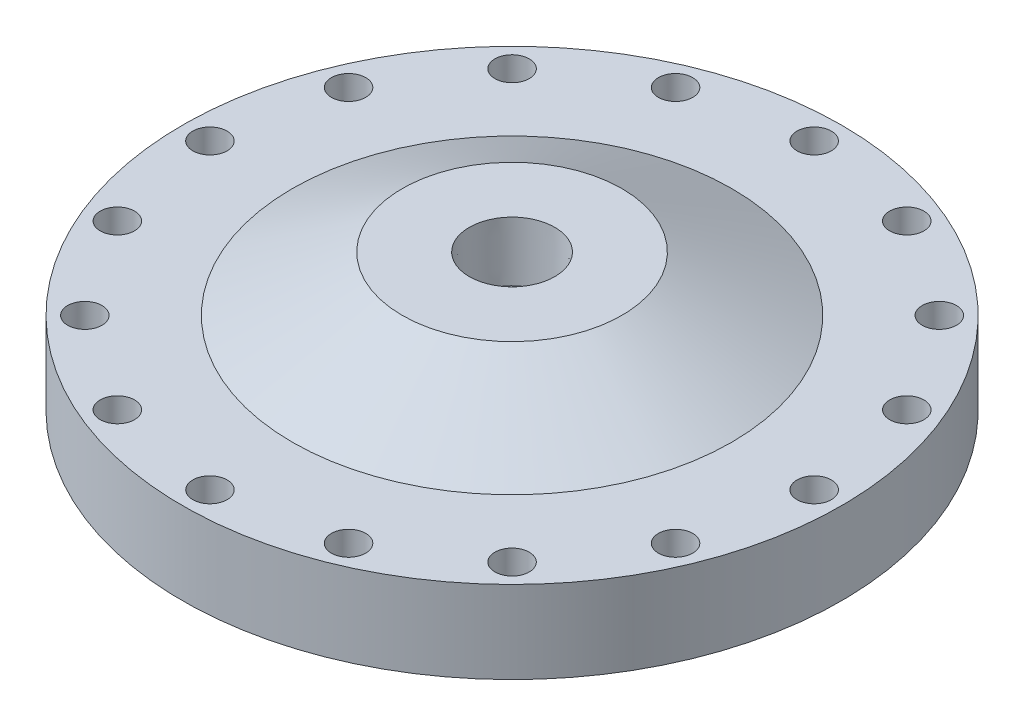
ISO-10303-21;
HEADER;
FILE_DESCRIPTION(('STEP AP214'),'2;1');
FILE_NAME('part.step','',(''),(''),'','','');
FILE_SCHEMA(('AUTOMOTIVE_DESIGN { 1 0 10303 214 1 1 1 1 }'));
ENDSEC;
DATA;
#1=APPLICATION_CONTEXT('core data for automotive mechanical design processes');
#2=APPLICATION_PROTOCOL_DEFINITION('international standard','automotive_design',2000,#1);
#3=PRODUCT_CONTEXT('',#1,'mechanical');
#4=PRODUCT('Part','Part','',(#3));
#5=PRODUCT_RELATED_PRODUCT_CATEGORY('part','',(#4));
#6=PRODUCT_DEFINITION_FORMATION('','',#4);
#7=PRODUCT_DEFINITION_CONTEXT('part definition',#1,'design');
#8=PRODUCT_DEFINITION('design','',#6,#7);
#9=PRODUCT_DEFINITION_SHAPE('','',#8);
#10=(LENGTH_UNIT() NAMED_UNIT(*) SI_UNIT(.MILLI.,.METRE.));
#11=(NAMED_UNIT(*) PLANE_ANGLE_UNIT() SI_UNIT($,.RADIAN.));
#12=(NAMED_UNIT(*) SI_UNIT($,.STERADIAN.) SOLID_ANGLE_UNIT());
#13=UNCERTAINTY_MEASURE_WITH_UNIT(LENGTH_MEASURE(1.E-05),#10,'distance_accuracy_value','');
#14=(GEOMETRIC_REPRESENTATION_CONTEXT(3) GLOBAL_UNCERTAINTY_ASSIGNED_CONTEXT((#13)) GLOBAL_UNIT_ASSIGNED_CONTEXT((#10,
#11,#12)) REPRESENTATION_CONTEXT('',''));
#15=CARTESIAN_POINT('',(0.,0.,0.));
#16=DIRECTION('',(0.,0.,1.));
#17=DIRECTION('',(1.,0.,0.));
#18=AXIS2_PLACEMENT_3D('',#15,#16,#17);
#19=CARTESIAN_POINT('',(-50.8,-12.7,0.));
#20=DIRECTION('',(0.,-1.,0.));
#21=DIRECTION('',(0.,0.,-1.));
#22=AXIS2_PLACEMENT_3D('',#19,#20,#21);
#23=PLANE('',#22);
#24=CARTESIAN_POINT('',(-49.3914086658803,-12.7,-49.3914086658804));
#25=DIRECTION('',(0.,1.,0.));
#26=DIRECTION('',(-0.707106781186549,0.,0.707106781186546));
#27=AXIS2_PLACEMENT_3D('',#24,#25,#26);
#28=CIRCLE('',#27,3.96874999999999);
#29=CARTESIAN_POINT('',(-52.1977387037144,-12.7,-46.5850786280463));
#30=VERTEX_POINT('',#29);
#31=EDGE_CURVE('E115',#30,#30,#28,.T.);
#32=ORIENTED_EDGE('',*,*,#31,.F.);
#33=EDGE_LOOP('',(#32));
#34=FACE_BOUND('',#33,.T.);
#35=CARTESIAN_POINT('',(-26.7304377507013,-12.7,-64.5329853459134));
#36=DIRECTION('',(0.,1.,0.));
#37=DIRECTION('',(-0.923879532511288,0.,0.382683432365087));
#38=AXIS2_PLACEMENT_3D('',#35,#36,#37);
#39=CIRCLE('',#38,3.96874999999999);
#40=CARTESIAN_POINT('',(-30.3970846453555,-12.7,-63.0142104737145));
#41=VERTEX_POINT('',#40);
#42=EDGE_CURVE('E109',#41,#41,#39,.T.);
#43=ORIENTED_EDGE('',*,*,#42,.F.);
#44=EDGE_LOOP('',(#43));
#45=FACE_BOUND('',#44,.T.);
#46=CARTESIAN_POINT('',(2.43879971518193E-13,-12.7,-69.85));
#47=DIRECTION('',(0.,1.,0.));
#48=DIRECTION('',(-1.,0.,0.));
#49=AXIS2_PLACEMENT_3D('',#46,#47,#48);
#50=CIRCLE('',#49,3.96874999999999);
#51=CARTESIAN_POINT('',(-3.96874999999975,-12.7,-69.85));
#52=VERTEX_POINT('',#51);
#53=EDGE_CURVE('E103',#52,#52,#50,.T.);
#54=ORIENTED_EDGE('',*,*,#53,.F.);
#55=EDGE_LOOP('',(#54));
#56=FACE_BOUND('',#55,.T.);
#57=CARTESIAN_POINT('',(26.7304377507018,-12.7,-64.5329853459133));
#58=DIRECTION('',(0.,1.,0.));
#59=DIRECTION('',(-0.923879532511285,0.,-0.382683432365094));
#60=AXIS2_PLACEMENT_3D('',#57,#58,#59);
#61=CIRCLE('',#60,3.96874999999999);
#62=CARTESIAN_POINT('',(23.0637908560476,-12.7,-66.0517602181122));
#63=VERTEX_POINT('',#62);
#64=EDGE_CURVE('E97',#63,#63,#61,.T.);
#65=ORIENTED_EDGE('',*,*,#64,.F.);
#66=EDGE_LOOP('',(#65));
#67=FACE_BOUND('',#66,.T.);
#68=CARTESIAN_POINT('',(49.3914086658806,-12.7,-49.3914086658801));
#69=DIRECTION('',(0.,1.,0.));
#70=DIRECTION('',(-0.707106781186544,0.,-0.707106781186551));
#71=AXIS2_PLACEMENT_3D('',#68,#69,#70);
#72=CIRCLE('',#71,3.96874999999999);
#73=CARTESIAN_POINT('',(46.5850786280465,-12.7,-52.1977387037142));
#74=VERTEX_POINT('',#73);
#75=EDGE_CURVE('E91',#74,#74,#72,.T.);
#76=ORIENTED_EDGE('',*,*,#75,.F.);
#77=EDGE_LOOP('',(#76));
#78=FACE_BOUND('',#77,.T.);
#79=CARTESIAN_POINT('',(64.5329853459135,-12.7,-26.7304377507011));
#80=DIRECTION('',(0.,1.,0.));
#81=DIRECTION('',(-0.382683432365084,0.,-0.923879532511289));
#82=AXIS2_PLACEMENT_3D('',#79,#80,#81);
#83=CIRCLE('',#82,3.96874999999999);
#84=CARTESIAN_POINT('',(63.0142104737146,-12.7,-30.3970846453553));
#85=VERTEX_POINT('',#84);
#86=EDGE_CURVE('E85',#85,#85,#83,.T.);
#87=ORIENTED_EDGE('',*,*,#86,.F.);
#88=EDGE_LOOP('',(#87));
#89=FACE_BOUND('',#88,.T.);
#90=CARTESIAN_POINT('',(69.85,-12.7,0.));
#91=DIRECTION('',(0.,1.,0.));
#92=DIRECTION('',(0.,0.,-1.));
#93=AXIS2_PLACEMENT_3D('',#90,#91,#92);
#94=CIRCLE('',#93,3.96874999999999);
#95=CARTESIAN_POINT('',(69.85,-12.7,-3.96874999999999));
#96=VERTEX_POINT('',#95);
#97=EDGE_CURVE('E77',#96,#96,#94,.T.);
#98=ORIENTED_EDGE('',*,*,#97,.F.);
#99=EDGE_LOOP('',(#98));
#100=FACE_BOUND('',#99,.T.);
#101=CARTESIAN_POINT('',(64.5329853459132,-12.7,26.730437750702));
#102=DIRECTION('',(0.,1.,0.));
#103=DIRECTION('',(0.382683432365097,0.,-0.923879532511284));
#104=AXIS2_PLACEMENT_3D('',#101,#102,#103);
#105=CIRCLE('',#104,3.96874999999999);
#106=CARTESIAN_POINT('',(66.0517602181121,-12.7,23.0637908560479));
#107=VERTEX_POINT('',#106);
#108=EDGE_CURVE('E78',#107,#107,#105,.T.);
#109=ORIENTED_EDGE('',*,*,#108,.F.);
#110=EDGE_LOOP('',(#109));
#111=FACE_BOUND('',#110,.T.);
#112=CARTESIAN_POINT('',(49.3914086658799,-12.7,49.3914086658808));
#113=DIRECTION('',(0.,1.,0.));
#114=DIRECTION('',(0.707106781186554,0.,-0.707106781186541));
#115=AXIS2_PLACEMENT_3D('',#112,#113,#114);
#116=CIRCLE('',#115,3.96874999999999);
#117=CARTESIAN_POINT('',(52.197738703714,-12.7,46.5850786280467));
#118=VERTEX_POINT('',#117);
#119=EDGE_CURVE('E151',#118,#118,#116,.T.);
#120=ORIENTED_EDGE('',*,*,#119,.F.);
#121=EDGE_LOOP('',(#120));
#122=FACE_BOUND('',#121,.T.);
#123=CARTESIAN_POINT('',(26.7304377507009,-12.7,64.5329853459136));
#124=DIRECTION('',(0.,1.,0.));
#125=DIRECTION('',(0.923879532511291,0.,-0.382683432365081));
#126=AXIS2_PLACEMENT_3D('',#123,#124,#125);
#127=CIRCLE('',#126,3.96874999999999);
#128=CARTESIAN_POINT('',(30.3970846453551,-12.7,63.0142104737147));
#129=VERTEX_POINT('',#128);
#130=EDGE_CURVE('E145',#129,#129,#127,.T.);
#131=ORIENTED_EDGE('',*,*,#130,.F.);
#132=EDGE_LOOP('',(#131));
#133=FACE_BOUND('',#132,.T.);
#134=CARTESIAN_POINT('',(-7.31639914554579E-13,-12.7,69.85));
#135=DIRECTION('',(0.,1.,0.));
#136=DIRECTION('',(1.,0.,0.));
#137=AXIS2_PLACEMENT_3D('',#134,#135,#136);
#138=CIRCLE('',#137,3.96874999999999);
#139=CARTESIAN_POINT('',(3.96874999999926,-12.7,69.85));
#140=VERTEX_POINT('',#139);
#141=EDGE_CURVE('E139',#140,#140,#138,.T.);
#142=ORIENTED_EDGE('',*,*,#141,.F.);
#143=EDGE_LOOP('',(#142));
#144=FACE_BOUND('',#143,.T.);
#145=CARTESIAN_POINT('',(-26.7304377507022,-12.7,64.5329853459131));
#146=DIRECTION('',(0.,1.,0.));
#147=DIRECTION('',(0.923879532511283,0.,0.3826834323651));
#148=AXIS2_PLACEMENT_3D('',#145,#146,#147);
#149=CIRCLE('',#148,3.96874999999999);
#150=CARTESIAN_POINT('',(-23.0637908560481,-12.7,66.0517602181121));
#151=VERTEX_POINT('',#150);
#152=EDGE_CURVE('E133',#151,#151,#149,.T.);
#153=ORIENTED_EDGE('',*,*,#152,.F.);
#154=EDGE_LOOP('',(#153));
#155=FACE_BOUND('',#154,.T.);
#156=CARTESIAN_POINT('',(-49.3914086658809,-12.7,49.3914086658797));
#157=DIRECTION('',(0.,1.,0.));
#158=DIRECTION('',(0.707106781186539,0.,0.707106781186556));
#159=AXIS2_PLACEMENT_3D('',#156,#157,#158);
#160=CIRCLE('',#159,3.96874999999999);
#161=CARTESIAN_POINT('',(-46.5850786280469,-12.7,52.1977387037139));
#162=VERTEX_POINT('',#161);
#163=EDGE_CURVE('E125',#162,#162,#160,.T.);
#164=ORIENTED_EDGE('',*,*,#163,.F.);
#165=EDGE_LOOP('',(#164));
#166=FACE_BOUND('',#165,.T.);
#167=CARTESIAN_POINT('',(-64.5329853459137,-12.7,26.7304377507006));
#168=DIRECTION('',(0.,1.,0.));
#169=DIRECTION('',(0.382683432365077,0.,0.923879532511292));
#170=AXIS2_PLACEMENT_3D('',#167,#168,#169);
#171=CIRCLE('',#170,3.96874999999999);
#172=CARTESIAN_POINT('',(-63.0142104737148,-12.7,30.3970846453548));
#173=VERTEX_POINT('',#172);
#174=EDGE_CURVE('E126',#173,#173,#171,.T.);
#175=ORIENTED_EDGE('',*,*,#174,.F.);
#176=EDGE_LOOP('',(#175));
#177=FACE_BOUND('',#176,.T.);
#178=CARTESIAN_POINT('',(-64.5329853459134,-12.7,-26.7304377507016));
#179=DIRECTION('',(0.,1.,0.));
#180=DIRECTION('',(-0.382683432365091,0.,0.923879532511287));
#181=AXIS2_PLACEMENT_3D('',#178,#179,#180);
#182=CIRCLE('',#181,3.96874999999999);
#183=CARTESIAN_POINT('',(-66.0517602181123,-12.7,-23.0637908560474));
#184=VERTEX_POINT('',#183);
#185=EDGE_CURVE('E70',#184,#184,#182,.T.);
#186=ORIENTED_EDGE('',*,*,#185,.F.);
#187=EDGE_LOOP('',(#186));
#188=FACE_BOUND('',#187,.T.);
#189=CARTESIAN_POINT('',(-69.85,-12.7,0.));
#190=DIRECTION('',(0.,1.,0.));
#191=DIRECTION('',(0.,0.,1.));
#192=AXIS2_PLACEMENT_3D('',#189,#190,#191);
#193=CIRCLE('',#192,3.96874999999999);
#194=CARTESIAN_POINT('',(-69.85,-12.7,3.96874999999999));
#195=VERTEX_POINT('',#194);
#196=EDGE_CURVE('E64',#195,#195,#193,.T.);
#197=ORIENTED_EDGE('',*,*,#196,.F.);
#198=EDGE_LOOP('',(#197));
#199=FACE_BOUND('',#198,.T.);
#200=CARTESIAN_POINT('',(0.,-12.7,0.));
#201=DIRECTION('',(0.,-1.,0.));
#202=DIRECTION('',(0.,0.,-1.));
#203=AXIS2_PLACEMENT_3D('',#200,#201,#202);
#204=CIRCLE('',#203,76.2);
#205=CARTESIAN_POINT('',(0.,-12.7,-76.2));
#206=VERTEX_POINT('',#205);
#207=EDGE_CURVE('E10',#206,#206,#204,.T.);
#208=ORIENTED_EDGE('',*,*,#207,.F.);
#209=EDGE_LOOP('',(#208));
#210=FACE_BOUND('',#209,.T.);
#211=CARTESIAN_POINT('',(0.,-12.7,0.));
#212=DIRECTION('',(0.,-1.,0.));
#213=DIRECTION('',(0.,0.,-1.));
#214=AXIS2_PLACEMENT_3D('',#211,#212,#213);
#215=CIRCLE('',#214,50.8);
#216=CARTESIAN_POINT('',(0.,-12.7,-50.8));
#217=VERTEX_POINT('',#216);
#218=EDGE_CURVE('E58',#217,#217,#215,.T.);
#219=ORIENTED_EDGE('',*,*,#218,.T.);
#220=EDGE_LOOP('',(#219));
#221=FACE_BOUND('',#220,.T.);
#222=ADVANCED_FACE('F36',(#34,#45,#56,#67,#78,#89,#100,#111,#122,#133,#144,#155,#166,#177,#188,
#199,#210,#221),#23,.F.);
#223=CARTESIAN_POINT('',(0.,-19.05,0.));
#224=DIRECTION('',(0.,-1.,0.));
#225=DIRECTION('',(0.,0.,-1.));
#226=AXIS2_PLACEMENT_3D('',#223,#224,#225);
#227=CYLINDRICAL_SURFACE('',#226,76.2);
#228=CARTESIAN_POINT('',(0.,-31.75,0.));
#229=DIRECTION('',(0.,-1.,0.));
#230=DIRECTION('',(0.,0.,-1.));
#231=AXIS2_PLACEMENT_3D('',#228,#229,#230);
#232=CIRCLE('',#231,76.2);
#233=CARTESIAN_POINT('',(0.,-31.75,-76.2));
#234=VERTEX_POINT('',#233);
#235=EDGE_CURVE('E42',#234,#234,#232,.T.);
#236=ORIENTED_EDGE('',*,*,#235,.F.);
#237=EDGE_LOOP('',(#236));
#238=FACE_BOUND('',#237,.T.);
#239=ORIENTED_EDGE('',*,*,#207,.T.);
#240=EDGE_LOOP('',(#239));
#241=FACE_BOUND('',#240,.T.);
#242=ADVANCED_FACE('F192',(#238,#241),#227,.T.);
#243=CARTESIAN_POINT('',(-76.2,-31.75,0.));
#244=DIRECTION('',(0.,1.,0.));
#245=DIRECTION('',(0.,0.,1.));
#246=AXIS2_PLACEMENT_3D('',#243,#244,#245);
#247=PLANE('',#246);
#248=CARTESIAN_POINT('',(-49.3914086658803,-31.75,-49.3914086658804));
#249=DIRECTION('',(0.,1.,0.));
#250=DIRECTION('',(-0.707106781186549,0.,0.707106781186546));
#251=AXIS2_PLACEMENT_3D('',#248,#249,#250);
#252=CIRCLE('',#251,3.96874999999999);
#253=CARTESIAN_POINT('',(-52.1977387037144,-31.75,-46.5850786280463));
#254=VERTEX_POINT('',#253);
#255=EDGE_CURVE('E73',#254,#254,#252,.T.);
#256=ORIENTED_EDGE('',*,*,#255,.T.);
#257=EDGE_LOOP('',(#256));
#258=FACE_BOUND('',#257,.T.);
#259=CARTESIAN_POINT('',(-26.7304377507013,-31.75,-64.5329853459134));
#260=DIRECTION('',(0.,1.,0.));
#261=DIRECTION('',(-0.923879532511288,0.,0.382683432365087));
#262=AXIS2_PLACEMENT_3D('',#259,#260,#261);
#263=CIRCLE('',#262,3.96874999999999);
#264=CARTESIAN_POINT('',(-30.3970846453555,-31.75,-63.0142104737145));
#265=VERTEX_POINT('',#264);
#266=EDGE_CURVE('E112',#265,#265,#263,.T.);
#267=ORIENTED_EDGE('',*,*,#266,.T.);
#268=EDGE_LOOP('',(#267));
#269=FACE_BOUND('',#268,.T.);
#270=CARTESIAN_POINT('',(2.43879971518193E-13,-31.75,-69.85));
#271=DIRECTION('',(0.,1.,0.));
#272=DIRECTION('',(-1.,0.,0.));
#273=AXIS2_PLACEMENT_3D('',#270,#271,#272);
#274=CIRCLE('',#273,3.96874999999999);
#275=CARTESIAN_POINT('',(-3.96874999999974,-31.75,-69.85));
#276=VERTEX_POINT('',#275);
#277=EDGE_CURVE('E106',#276,#276,#274,.T.);
#278=ORIENTED_EDGE('',*,*,#277,.T.);
#279=EDGE_LOOP('',(#278));
#280=FACE_BOUND('',#279,.T.);
#281=CARTESIAN_POINT('',(26.7304377507018,-31.75,-64.5329853459133));
#282=DIRECTION('',(0.,1.,0.));
#283=DIRECTION('',(-0.923879532511285,0.,-0.382683432365094));
#284=AXIS2_PLACEMENT_3D('',#281,#282,#283);
#285=CIRCLE('',#284,3.96874999999999);
#286=CARTESIAN_POINT('',(23.0637908560477,-31.75,-66.0517602181122));
#287=VERTEX_POINT('',#286);
#288=EDGE_CURVE('E100',#287,#287,#285,.T.);
#289=ORIENTED_EDGE('',*,*,#288,.T.);
#290=EDGE_LOOP('',(#289));
#291=FACE_BOUND('',#290,.T.);
#292=CARTESIAN_POINT('',(49.3914086658806,-31.75,-49.3914086658801));
#293=DIRECTION('',(0.,1.,0.));
#294=DIRECTION('',(-0.707106781186544,0.,-0.707106781186551));
#295=AXIS2_PLACEMENT_3D('',#292,#293,#294);
#296=CIRCLE('',#295,3.96874999999999);
#297=CARTESIAN_POINT('',(46.5850786280465,-31.75,-52.1977387037142));
#298=VERTEX_POINT('',#297);
#299=EDGE_CURVE('E94',#298,#298,#296,.T.);
#300=ORIENTED_EDGE('',*,*,#299,.T.);
#301=EDGE_LOOP('',(#300));
#302=FACE_BOUND('',#301,.T.);
#303=CARTESIAN_POINT('',(64.5329853459135,-31.75,-26.7304377507011));
#304=DIRECTION('',(0.,1.,0.));
#305=DIRECTION('',(-0.382683432365084,0.,-0.923879532511289));
#306=AXIS2_PLACEMENT_3D('',#303,#304,#305);
#307=CIRCLE('',#306,3.96874999999999);
#308=CARTESIAN_POINT('',(63.0142104737146,-31.75,-30.3970846453553));
#309=VERTEX_POINT('',#308);
#310=EDGE_CURVE('E88',#309,#309,#307,.T.);
#311=ORIENTED_EDGE('',*,*,#310,.T.);
#312=EDGE_LOOP('',(#311));
#313=FACE_BOUND('',#312,.T.);
#314=CARTESIAN_POINT('',(69.85,-31.75,0.));
#315=DIRECTION('',(0.,1.,0.));
#316=DIRECTION('',(0.,0.,-1.));
#317=AXIS2_PLACEMENT_3D('',#314,#315,#316);
#318=CIRCLE('',#317,3.96874999999999);
#319=CARTESIAN_POINT('',(69.85,-31.75,-3.96874999999999));
#320=VERTEX_POINT('',#319);
#321=EDGE_CURVE('E82',#320,#320,#318,.T.);
#322=ORIENTED_EDGE('',*,*,#321,.T.);
#323=EDGE_LOOP('',(#322));
#324=FACE_BOUND('',#323,.T.);
#325=CARTESIAN_POINT('',(64.5329853459132,-31.75,26.730437750702));
#326=DIRECTION('',(0.,1.,0.));
#327=DIRECTION('',(0.382683432365097,0.,-0.923879532511284));
#328=AXIS2_PLACEMENT_3D('',#325,#326,#327);
#329=CIRCLE('',#328,3.96874999999999);
#330=CARTESIAN_POINT('',(66.0517602181121,-31.75,23.0637908560479));
#331=VERTEX_POINT('',#330);
#332=EDGE_CURVE('E74',#331,#331,#329,.T.);
#333=ORIENTED_EDGE('',*,*,#332,.T.);
#334=EDGE_LOOP('',(#333));
#335=FACE_BOUND('',#334,.T.);
#336=CARTESIAN_POINT('',(49.3914086658799,-31.75,49.3914086658808));
#337=DIRECTION('',(0.,1.,0.));
#338=DIRECTION('',(0.707106781186554,0.,-0.707106781186541));
#339=AXIS2_PLACEMENT_3D('',#336,#337,#338);
#340=CIRCLE('',#339,3.96874999999999);
#341=CARTESIAN_POINT('',(52.197738703714,-31.75,46.5850786280467));
#342=VERTEX_POINT('',#341);
#343=EDGE_CURVE('E81',#342,#342,#340,.T.);
#344=ORIENTED_EDGE('',*,*,#343,.T.);
#345=EDGE_LOOP('',(#344));
#346=FACE_BOUND('',#345,.T.);
#347=CARTESIAN_POINT('',(26.7304377507009,-31.75,64.5329853459136));
#348=DIRECTION('',(0.,1.,0.));
#349=DIRECTION('',(0.923879532511291,0.,-0.382683432365081));
#350=AXIS2_PLACEMENT_3D('',#347,#348,#349);
#351=CIRCLE('',#350,3.96874999999999);
#352=CARTESIAN_POINT('',(30.397084645355,-31.75,63.0142104737147));
#353=VERTEX_POINT('',#352);
#354=EDGE_CURVE('E148',#353,#353,#351,.T.);
#355=ORIENTED_EDGE('',*,*,#354,.T.);
#356=EDGE_LOOP('',(#355));
#357=FACE_BOUND('',#356,.T.);
#358=CARTESIAN_POINT('',(-7.31639914554579E-13,-31.75,69.85));
#359=DIRECTION('',(0.,1.,0.));
#360=DIRECTION('',(1.,0.,0.));
#361=AXIS2_PLACEMENT_3D('',#358,#359,#360);
#362=CIRCLE('',#361,3.96874999999999);
#363=CARTESIAN_POINT('',(3.96874999999925,-31.75,69.85));
#364=VERTEX_POINT('',#363);
#365=EDGE_CURVE('E142',#364,#364,#362,.T.);
#366=ORIENTED_EDGE('',*,*,#365,.T.);
#367=EDGE_LOOP('',(#366));
#368=FACE_BOUND('',#367,.T.);
#369=CARTESIAN_POINT('',(-26.7304377507022,-31.75,64.5329853459131));
#370=DIRECTION('',(0.,1.,0.));
#371=DIRECTION('',(0.923879532511283,0.,0.3826834323651));
#372=AXIS2_PLACEMENT_3D('',#369,#370,#371);
#373=CIRCLE('',#372,3.96874999999999);
#374=CARTESIAN_POINT('',(-23.0637908560481,-31.75,66.0517602181121));
#375=VERTEX_POINT('',#374);
#376=EDGE_CURVE('E136',#375,#375,#373,.T.);
#377=ORIENTED_EDGE('',*,*,#376,.T.);
#378=EDGE_LOOP('',(#377));
#379=FACE_BOUND('',#378,.T.);
#380=CARTESIAN_POINT('',(-49.3914086658809,-31.75,49.3914086658797));
#381=DIRECTION('',(0.,1.,0.));
#382=DIRECTION('',(0.707106781186539,0.,0.707106781186556));
#383=AXIS2_PLACEMENT_3D('',#380,#381,#382);
#384=CIRCLE('',#383,3.96874999999999);
#385=CARTESIAN_POINT('',(-46.5850786280469,-31.75,52.1977387037139));
#386=VERTEX_POINT('',#385);
#387=EDGE_CURVE('E130',#386,#386,#384,.T.);
#388=ORIENTED_EDGE('',*,*,#387,.T.);
#389=EDGE_LOOP('',(#388));
#390=FACE_BOUND('',#389,.T.);
#391=CARTESIAN_POINT('',(-64.5329853459137,-31.75,26.7304377507006));
#392=DIRECTION('',(0.,1.,0.));
#393=DIRECTION('',(0.382683432365077,0.,0.923879532511292));
#394=AXIS2_PLACEMENT_3D('',#391,#392,#393);
#395=CIRCLE('',#394,3.96874999999999);
#396=CARTESIAN_POINT('',(-63.0142104737148,-31.75,30.3970846453548));
#397=VERTEX_POINT('',#396);
#398=EDGE_CURVE('E122',#397,#397,#395,.T.);
#399=ORIENTED_EDGE('',*,*,#398,.T.);
#400=EDGE_LOOP('',(#399));
#401=FACE_BOUND('',#400,.T.);
#402=CARTESIAN_POINT('',(-64.5329853459134,-31.75,-26.7304377507016));
#403=DIRECTION('',(0.,1.,0.));
#404=DIRECTION('',(-0.382683432365091,0.,0.923879532511287));
#405=AXIS2_PLACEMENT_3D('',#402,#403,#404);
#406=CIRCLE('',#405,3.96874999999999);
#407=CARTESIAN_POINT('',(-66.0517602181123,-31.75,-23.0637908560474));
#408=VERTEX_POINT('',#407);
#409=EDGE_CURVE('E67',#408,#408,#406,.T.);
#410=ORIENTED_EDGE('',*,*,#409,.T.);
#411=EDGE_LOOP('',(#410));
#412=FACE_BOUND('',#411,.T.);
#413=CARTESIAN_POINT('',(-69.85,-31.75,0.));
#414=DIRECTION('',(0.,1.,0.));
#415=DIRECTION('',(0.,0.,1.));
#416=AXIS2_PLACEMENT_3D('',#413,#414,#415);
#417=CIRCLE('',#416,3.96874999999999);
#418=CARTESIAN_POINT('',(-69.85,-31.75,3.96874999999999));
#419=VERTEX_POINT('',#418);
#420=EDGE_CURVE('E61',#419,#419,#417,.T.);
#421=ORIENTED_EDGE('',*,*,#420,.T.);
#422=EDGE_LOOP('',(#421));
#423=FACE_BOUND('',#422,.T.);
#424=CARTESIAN_POINT('',(0.,-31.75,0.));
#425=DIRECTION('',(0.,-1.,0.));
#426=DIRECTION('',(0.,0.,-1.));
#427=AXIS2_PLACEMENT_3D('',#424,#425,#426);
#428=CIRCLE('',#427,42.8625);
#429=CARTESIAN_POINT('',(0.,-31.75,-42.8625));
#430=VERTEX_POINT('',#429);
#431=EDGE_CURVE('E46',#430,#430,#428,.T.);
#432=ORIENTED_EDGE('',*,*,#431,.F.);
#433=EDGE_LOOP('',(#432));
#434=FACE_BOUND('',#433,.T.);
#435=ORIENTED_EDGE('',*,*,#235,.T.);
#436=EDGE_LOOP('',(#435));
#437=FACE_BOUND('',#436,.T.);
#438=ADVANCED_FACE('F197',(#258,#269,#280,#291,#302,#313,#324,#335,#346,#357,#368,#379,#390,
#401,#412,#423,#434,#437),#247,.F.);
#439=CARTESIAN_POINT('',(0.,-31.75,0.));
#440=DIRECTION('',(0.,-1.,0.));
#441=DIRECTION('',(0.,0.,-1.));
#442=AXIS2_PLACEMENT_3D('',#439,#440,#441);
#443=CONICAL_SURFACE('',#442,42.8625,1.13095374397916);
#444=CARTESIAN_POINT('',(0.,-19.05,0.));
#445=DIRECTION('',(0.,-1.,0.));
#446=DIRECTION('',(0.,0.,-1.));
#447=AXIS2_PLACEMENT_3D('',#444,#445,#446);
#448=CIRCLE('',#447,15.875);
#449=CARTESIAN_POINT('',(0.,-19.05,-15.875));
#450=VERTEX_POINT('',#449);
#451=EDGE_CURVE('E50',#450,#450,#448,.T.);
#452=ORIENTED_EDGE('',*,*,#451,.F.);
#453=EDGE_LOOP('',(#452));
#454=FACE_BOUND('',#453,.T.);
#455=ORIENTED_EDGE('',*,*,#431,.T.);
#456=EDGE_LOOP('',(#455));
#457=FACE_BOUND('',#456,.T.);
#458=ADVANCED_FACE('F237',(#454,#457),#443,.F.);
#459=CARTESIAN_POINT('',(-15.875,-19.05,0.));
#460=DIRECTION('',(0.,1.,0.));
#461=DIRECTION('',(0.,0.,1.));
#462=AXIS2_PLACEMENT_3D('',#459,#460,#461);
#463=PLANE('',#462);
#464=CARTESIAN_POINT('',(0.,-19.05,0.));
#465=DIRECTION('',(0.,1.,0.));
#466=DIRECTION('',(0.,0.,1.));
#467=AXIS2_PLACEMENT_3D('',#464,#465,#466);
#468=CIRCLE('',#467,8.9281);
#469=CARTESIAN_POINT('',(0.,-19.05,8.9281));
#470=VERTEX_POINT('',#469);
#471=EDGE_CURVE('E129',#470,#470,#468,.T.);
#472=ORIENTED_EDGE('',*,*,#471,.T.);
#473=EDGE_LOOP('',(#472));
#474=FACE_BOUND('',#473,.T.);
#475=ORIENTED_EDGE('',*,*,#451,.T.);
#476=EDGE_LOOP('',(#475));
#477=FACE_BOUND('',#476,.T.);
#478=ADVANCED_FACE('F176',(#474,#477),#463,.F.);
#479=CARTESIAN_POINT('',(-25.4,0.,0.));
#480=DIRECTION('',(0.,-1.,0.));
#481=DIRECTION('',(0.,0.,-1.));
#482=AXIS2_PLACEMENT_3D('',#479,#480,#481);
#483=PLANE('',#482);
#484=CARTESIAN_POINT('',(0.,0.,0.));
#485=DIRECTION('',(0.,1.,0.));
#486=DIRECTION('',(0.,0.,1.));
#487=AXIS2_PLACEMENT_3D('',#484,#485,#486);
#488=CIRCLE('',#487,9.8827971);
#489=CARTESIAN_POINT('',(0.,0.,9.8827971));
#490=VERTEX_POINT('',#489);
#491=EDGE_CURVE('E166',#490,#490,#488,.T.);
#492=ORIENTED_EDGE('',*,*,#491,.F.);
#493=EDGE_LOOP('',(#492));
#494=FACE_BOUND('',#493,.T.);
#495=CARTESIAN_POINT('',(0.,0.,0.));
#496=DIRECTION('',(0.,-1.,0.));
#497=DIRECTION('',(0.,0.,-1.));
#498=AXIS2_PLACEMENT_3D('',#495,#496,#497);
#499=CIRCLE('',#498,25.4);
#500=CARTESIAN_POINT('',(0.,0.,-25.4));
#501=VERTEX_POINT('',#500);
#502=EDGE_CURVE('E55',#501,#501,#499,.T.);
#503=ORIENTED_EDGE('',*,*,#502,.F.);
#504=EDGE_LOOP('',(#503));
#505=FACE_BOUND('',#504,.T.);
#506=ADVANCED_FACE('F172',(#494,#505),#483,.F.);
#507=CARTESIAN_POINT('',(0.,0.,0.));
#508=DIRECTION('',(0.,-1.,0.));
#509=DIRECTION('',(0.,0.,-1.));
#510=AXIS2_PLACEMENT_3D('',#507,#508,#509);
#511=CONICAL_SURFACE('',#510,25.4,1.10714871779409);
#512=ORIENTED_EDGE('',*,*,#218,.F.);
#513=EDGE_LOOP('',(#512));
#514=FACE_BOUND('',#513,.T.);
#515=ORIENTED_EDGE('',*,*,#502,.T.);
#516=EDGE_LOOP('',(#515));
#517=FACE_BOUND('',#516,.T.);
#518=ADVANCED_FACE('F175',(#514,#517),#511,.T.);
#519=CARTESIAN_POINT('',(-69.85,-12.7,0.));
#520=DIRECTION('',(0.,1.,0.));
#521=DIRECTION('',(0.,0.,1.));
#522=AXIS2_PLACEMENT_3D('',#519,#520,#521);
#523=CYLINDRICAL_SURFACE('',#522,3.96874999999999);
#524=ORIENTED_EDGE('',*,*,#196,.T.);
#525=EDGE_LOOP('',(#524));
#526=FACE_BOUND('',#525,.T.);
#527=ORIENTED_EDGE('',*,*,#420,.F.);
#528=EDGE_LOOP('',(#527));
#529=FACE_BOUND('',#528,.T.);
#530=ADVANCED_FACE('F181',(#526,#529),#523,.F.);
#531=CARTESIAN_POINT('',(-64.5329853459134,-12.7,-26.7304377507016));
#532=DIRECTION('',(0.,1.,0.));
#533=DIRECTION('',(-0.382683432365091,0.,0.923879532511287));
#534=AXIS2_PLACEMENT_3D('',#531,#532,#533);
#535=CYLINDRICAL_SURFACE('',#534,3.96874999999999);
#536=ORIENTED_EDGE('',*,*,#185,.T.);
#537=EDGE_LOOP('',(#536));
#538=FACE_BOUND('',#537,.T.);
#539=ORIENTED_EDGE('',*,*,#409,.F.);
#540=EDGE_LOOP('',(#539));
#541=FACE_BOUND('',#540,.T.);
#542=ADVANCED_FACE('F187',(#538,#541),#535,.F.);
#543=CARTESIAN_POINT('',(-64.5329853459137,-12.7,26.7304377507006));
#544=DIRECTION('',(0.,1.,0.));
#545=DIRECTION('',(0.382683432365077,0.,0.923879532511292));
#546=AXIS2_PLACEMENT_3D('',#543,#544,#545);
#547=CYLINDRICAL_SURFACE('',#546,3.96874999999999);
#548=ORIENTED_EDGE('',*,*,#174,.T.);
#549=EDGE_LOOP('',(#548));
#550=FACE_BOUND('',#549,.T.);
#551=ORIENTED_EDGE('',*,*,#398,.F.);
#552=EDGE_LOOP('',(#551));
#553=FACE_BOUND('',#552,.T.);
#554=ADVANCED_FACE('F294',(#550,#553),#547,.F.);
#555=CARTESIAN_POINT('',(-49.3914086658809,-12.7,49.3914086658797));
#556=DIRECTION('',(0.,1.,0.));
#557=DIRECTION('',(0.707106781186539,0.,0.707106781186556));
#558=AXIS2_PLACEMENT_3D('',#555,#556,#557);
#559=CYLINDRICAL_SURFACE('',#558,3.96874999999999);
#560=ORIENTED_EDGE('',*,*,#163,.T.);
#561=EDGE_LOOP('',(#560));
#562=FACE_BOUND('',#561,.T.);
#563=ORIENTED_EDGE('',*,*,#387,.F.);
#564=EDGE_LOOP('',(#563));
#565=FACE_BOUND('',#564,.T.);
#566=ADVANCED_FACE('F290',(#562,#565),#559,.F.);
#567=CARTESIAN_POINT('',(-26.7304377507022,-12.7,64.5329853459131));
#568=DIRECTION('',(0.,1.,0.));
#569=DIRECTION('',(0.923879532511283,0.,0.3826834323651));
#570=AXIS2_PLACEMENT_3D('',#567,#568,#569);
#571=CYLINDRICAL_SURFACE('',#570,3.96874999999999);
#572=ORIENTED_EDGE('',*,*,#152,.T.);
#573=EDGE_LOOP('',(#572));
#574=FACE_BOUND('',#573,.T.);
#575=ORIENTED_EDGE('',*,*,#376,.F.);
#576=EDGE_LOOP('',(#575));
#577=FACE_BOUND('',#576,.T.);
#578=ADVANCED_FACE('F286',(#574,#577),#571,.F.);
#579=CARTESIAN_POINT('',(-7.31639914554579E-13,-12.7,69.85));
#580=DIRECTION('',(0.,1.,0.));
#581=DIRECTION('',(1.,0.,0.));
#582=AXIS2_PLACEMENT_3D('',#579,#580,#581);
#583=CYLINDRICAL_SURFACE('',#582,3.96874999999999);
#584=ORIENTED_EDGE('',*,*,#141,.T.);
#585=EDGE_LOOP('',(#584));
#586=FACE_BOUND('',#585,.T.);
#587=ORIENTED_EDGE('',*,*,#365,.F.);
#588=EDGE_LOOP('',(#587));
#589=FACE_BOUND('',#588,.T.);
#590=ADVANCED_FACE('F282',(#586,#589),#583,.F.);
#591=CARTESIAN_POINT('',(26.7304377507009,-12.7,64.5329853459136));
#592=DIRECTION('',(0.,1.,0.));
#593=DIRECTION('',(0.923879532511291,0.,-0.382683432365081));
#594=AXIS2_PLACEMENT_3D('',#591,#592,#593);
#595=CYLINDRICAL_SURFACE('',#594,3.96874999999999);
#596=ORIENTED_EDGE('',*,*,#130,.T.);
#597=EDGE_LOOP('',(#596));
#598=FACE_BOUND('',#597,.T.);
#599=ORIENTED_EDGE('',*,*,#354,.F.);
#600=EDGE_LOOP('',(#599));
#601=FACE_BOUND('',#600,.T.);
#602=ADVANCED_FACE('F278',(#598,#601),#595,.F.);
#603=CARTESIAN_POINT('',(49.3914086658799,-12.7,49.3914086658808));
#604=DIRECTION('',(0.,1.,0.));
#605=DIRECTION('',(0.707106781186554,0.,-0.707106781186541));
#606=AXIS2_PLACEMENT_3D('',#603,#604,#605);
#607=CYLINDRICAL_SURFACE('',#606,3.96874999999999);
#608=ORIENTED_EDGE('',*,*,#119,.T.);
#609=EDGE_LOOP('',(#608));
#610=FACE_BOUND('',#609,.T.);
#611=ORIENTED_EDGE('',*,*,#343,.F.);
#612=EDGE_LOOP('',(#611));
#613=FACE_BOUND('',#612,.T.);
#614=ADVANCED_FACE('F274',(#610,#613),#607,.F.);
#615=CARTESIAN_POINT('',(64.5329853459132,-12.7,26.730437750702));
#616=DIRECTION('',(0.,1.,0.));
#617=DIRECTION('',(0.382683432365097,0.,-0.923879532511284));
#618=AXIS2_PLACEMENT_3D('',#615,#616,#617);
#619=CYLINDRICAL_SURFACE('',#618,3.96874999999999);
#620=ORIENTED_EDGE('',*,*,#108,.T.);
#621=EDGE_LOOP('',(#620));
#622=FACE_BOUND('',#621,.T.);
#623=ORIENTED_EDGE('',*,*,#332,.F.);
#624=EDGE_LOOP('',(#623));
#625=FACE_BOUND('',#624,.T.);
#626=ADVANCED_FACE('F277',(#622,#625),#619,.F.);
#627=CARTESIAN_POINT('',(69.85,-12.7,0.));
#628=DIRECTION('',(0.,1.,0.));
#629=DIRECTION('',(0.,0.,-1.));
#630=AXIS2_PLACEMENT_3D('',#627,#628,#629);
#631=CYLINDRICAL_SURFACE('',#630,3.96874999999999);
#632=ORIENTED_EDGE('',*,*,#97,.T.);
#633=EDGE_LOOP('',(#632));
#634=FACE_BOUND('',#633,.T.);
#635=ORIENTED_EDGE('',*,*,#321,.F.);
#636=EDGE_LOOP('',(#635));
#637=FACE_BOUND('',#636,.T.);
#638=ADVANCED_FACE('F321',(#634,#637),#631,.F.);
#639=CARTESIAN_POINT('',(64.5329853459135,-12.7,-26.7304377507011));
#640=DIRECTION('',(0.,1.,0.));
#641=DIRECTION('',(-0.382683432365084,0.,-0.923879532511289));
#642=AXIS2_PLACEMENT_3D('',#639,#640,#641);
#643=CYLINDRICAL_SURFACE('',#642,3.96874999999999);
#644=ORIENTED_EDGE('',*,*,#86,.T.);
#645=EDGE_LOOP('',(#644));
#646=FACE_BOUND('',#645,.T.);
#647=ORIENTED_EDGE('',*,*,#310,.F.);
#648=EDGE_LOOP('',(#647));
#649=FACE_BOUND('',#648,.T.);
#650=ADVANCED_FACE('F317',(#646,#649),#643,.F.);
#651=CARTESIAN_POINT('',(49.3914086658806,-12.7,-49.3914086658801));
#652=DIRECTION('',(0.,1.,0.));
#653=DIRECTION('',(-0.707106781186544,0.,-0.707106781186551));
#654=AXIS2_PLACEMENT_3D('',#651,#652,#653);
#655=CYLINDRICAL_SURFACE('',#654,3.96874999999999);
#656=ORIENTED_EDGE('',*,*,#75,.T.);
#657=EDGE_LOOP('',(#656));
#658=FACE_BOUND('',#657,.T.);
#659=ORIENTED_EDGE('',*,*,#299,.F.);
#660=EDGE_LOOP('',(#659));
#661=FACE_BOUND('',#660,.T.);
#662=ADVANCED_FACE('F313',(#658,#661),#655,.F.);
#663=CARTESIAN_POINT('',(26.7304377507018,-12.7,-64.5329853459133));
#664=DIRECTION('',(0.,1.,0.));
#665=DIRECTION('',(-0.923879532511285,0.,-0.382683432365094));
#666=AXIS2_PLACEMENT_3D('',#663,#664,#665);
#667=CYLINDRICAL_SURFACE('',#666,3.96874999999999);
#668=ORIENTED_EDGE('',*,*,#64,.T.);
#669=EDGE_LOOP('',(#668));
#670=FACE_BOUND('',#669,.T.);
#671=ORIENTED_EDGE('',*,*,#288,.F.);
#672=EDGE_LOOP('',(#671));
#673=FACE_BOUND('',#672,.T.);
#674=ADVANCED_FACE('F309',(#670,#673),#667,.F.);
#675=CARTESIAN_POINT('',(2.43879971518193E-13,-12.7,-69.85));
#676=DIRECTION('',(0.,1.,0.));
#677=DIRECTION('',(-1.,0.,0.));
#678=AXIS2_PLACEMENT_3D('',#675,#676,#677);
#679=CYLINDRICAL_SURFACE('',#678,3.96874999999999);
#680=ORIENTED_EDGE('',*,*,#53,.T.);
#681=EDGE_LOOP('',(#680));
#682=FACE_BOUND('',#681,.T.);
#683=ORIENTED_EDGE('',*,*,#277,.F.);
#684=EDGE_LOOP('',(#683));
#685=FACE_BOUND('',#684,.T.);
#686=ADVANCED_FACE('F305',(#682,#685),#679,.F.);
#687=CARTESIAN_POINT('',(-26.7304377507013,-12.7,-64.5329853459134));
#688=DIRECTION('',(0.,1.,0.));
#689=DIRECTION('',(-0.923879532511288,0.,0.382683432365087));
#690=AXIS2_PLACEMENT_3D('',#687,#688,#689);
#691=CYLINDRICAL_SURFACE('',#690,3.96874999999999);
#692=ORIENTED_EDGE('',*,*,#42,.T.);
#693=EDGE_LOOP('',(#692));
#694=FACE_BOUND('',#693,.T.);
#695=ORIENTED_EDGE('',*,*,#266,.F.);
#696=EDGE_LOOP('',(#695));
#697=FACE_BOUND('',#696,.T.);
#698=ADVANCED_FACE('F301',(#694,#697),#691,.F.);
#699=CARTESIAN_POINT('',(-49.3914086658803,-12.7,-49.3914086658804));
#700=DIRECTION('',(0.,1.,0.));
#701=DIRECTION('',(-0.707106781186549,0.,0.707106781186546));
#702=AXIS2_PLACEMENT_3D('',#699,#700,#701);
#703=CYLINDRICAL_SURFACE('',#702,3.96874999999999);
#704=ORIENTED_EDGE('',*,*,#31,.T.);
#705=EDGE_LOOP('',(#704));
#706=FACE_BOUND('',#705,.T.);
#707=ORIENTED_EDGE('',*,*,#255,.F.);
#708=EDGE_LOOP('',(#707));
#709=FACE_BOUND('',#708,.T.);
#710=ADVANCED_FACE('F260',(#706,#709),#703,.F.);
#711=CARTESIAN_POINT('',(0.,0.,0.));
#712=DIRECTION('',(0.,1.,0.));
#713=DIRECTION('',(0.,0.,1.));
#714=AXIS2_PLACEMENT_3D('',#711,#712,#713);
#715=CYLINDRICAL_SURFACE('',#714,8.9281);
#716=ORIENTED_EDGE('',*,*,#471,.F.);
#717=EDGE_LOOP('',(#716));
#718=FACE_BOUND('',#717,.T.);
#719=CARTESIAN_POINT('',(0.,-13.462,0.));
#720=DIRECTION('',(0.,1.,0.));
#721=DIRECTION('',(0.,0.,1.));
#722=AXIS2_PLACEMENT_3D('',#719,#720,#721);
#723=CIRCLE('',#722,8.9281);
#724=CARTESIAN_POINT('',(0.,-13.462,8.9281));
#725=VERTEX_POINT('',#724);
#726=EDGE_CURVE('E160',#725,#725,#723,.T.);
#727=ORIENTED_EDGE('',*,*,#726,.T.);
#728=EDGE_LOOP('',(#727));
#729=FACE_BOUND('',#728,.T.);
#730=ADVANCED_FACE('F256',(#718,#729),#715,.F.);
#731=CARTESIAN_POINT('',(8.9281,-13.462,0.));
#732=DIRECTION('',(0.,-1.,0.));
#733=DIRECTION('',(0.,0.,-1.));
#734=AXIS2_PLACEMENT_3D('',#731,#732,#733);
#735=PLANE('',#734);
#736=ORIENTED_EDGE('',*,*,#726,.F.);
#737=EDGE_LOOP('',(#736));
#738=FACE_BOUND('',#737,.T.);
#739=CARTESIAN_POINT('',(0.,-13.462,0.));
#740=DIRECTION('',(0.,1.,0.));
#741=DIRECTION('',(0.,0.,1.));
#742=AXIS2_PLACEMENT_3D('',#739,#740,#741);
#743=CIRCLE('',#742,9.47972679208631);
#744=CARTESIAN_POINT('',(0.,-13.462,9.47972679208631));
#745=VERTEX_POINT('',#744);
#746=EDGE_CURVE('E163',#745,#745,#743,.T.);
#747=ORIENTED_EDGE('',*,*,#746,.T.);
#748=EDGE_LOOP('',(#747));
#749=FACE_BOUND('',#748,.T.);
#750=ADVANCED_FACE('F259',(#738,#749),#735,.F.);
#751=CARTESIAN_POINT('',(0.,0.,0.));
#752=DIRECTION('',(0.,1.,0.));
#753=DIRECTION('',(0.,0.,1.));
#754=AXIS2_PLACEMENT_3D('',#751,#752,#753);
#755=CONICAL_SURFACE('',#754,9.8827971,0.0299323966717028);
#756=ORIENTED_EDGE('',*,*,#746,.F.);
#757=EDGE_LOOP('',(#756));
#758=FACE_BOUND('',#757,.T.);
#759=ORIENTED_EDGE('',*,*,#491,.T.);
#760=EDGE_LOOP('',(#759));
#761=FACE_BOUND('',#760,.T.);
#762=ADVANCED_FACE('F170',(#758,#761),#755,.F.);
#763=CLOSED_SHELL('',(#222,#242,#438,#458,#478,#506,#518,#530,#542,#554,#566,#578,#590,#602,
#614,#626,#638,#650,#662,#674,#686,#698,#710,#730,#750,#762));
#764=MANIFOLD_SOLID_BREP('B2',#763);
#765=ADVANCED_BREP_SHAPE_REPRESENTATION('',(#18,#764),#14);
#766=SHAPE_DEFINITION_REPRESENTATION(#9,#765);
ENDSEC;
END-ISO-10303-21;
